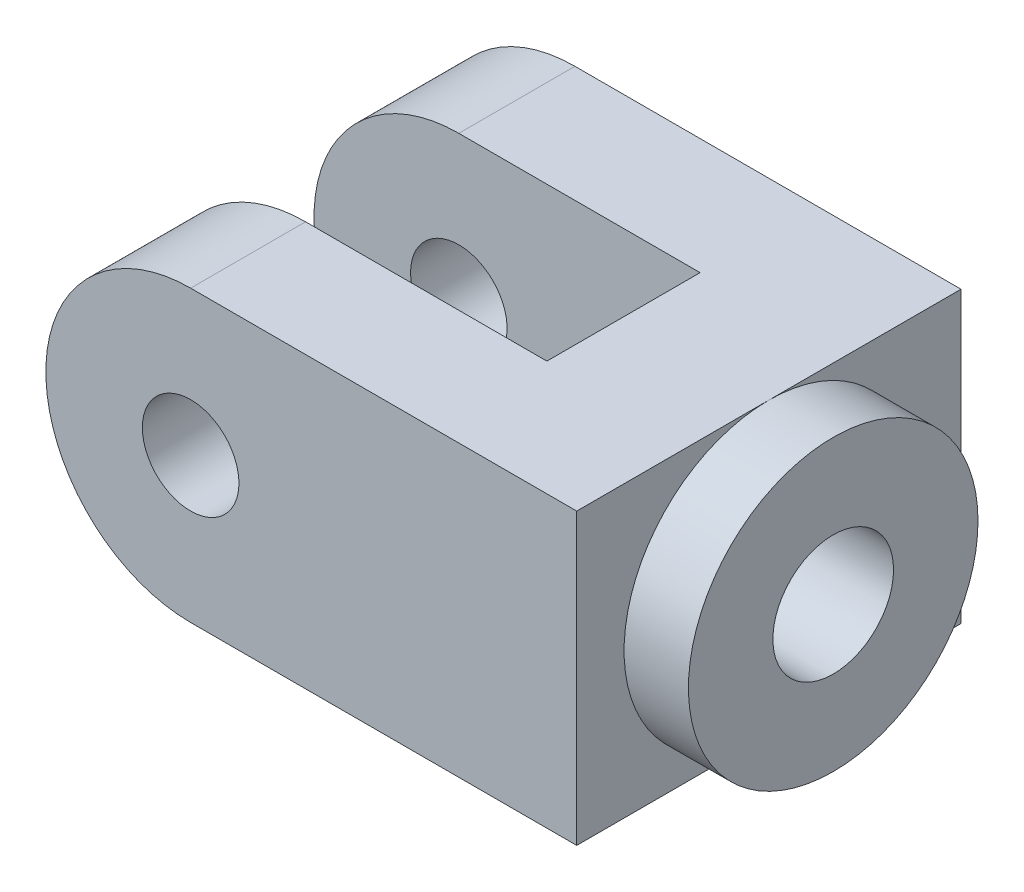
ISO-10303-21;
HEADER;
FILE_DESCRIPTION(('STEP AP214'),'2;1');
FILE_NAME('part.step','',(''),(''),'','','');
FILE_SCHEMA(('AUTOMOTIVE_DESIGN { 1 0 10303 214 1 1 1 1 }'));
ENDSEC;
DATA;
#1=APPLICATION_CONTEXT('core data for automotive mechanical design processes');
#2=APPLICATION_PROTOCOL_DEFINITION('international standard','automotive_design',2000,#1);
#3=PRODUCT_CONTEXT('',#1,'mechanical');
#4=PRODUCT('Part','Part','',(#3));
#5=PRODUCT_RELATED_PRODUCT_CATEGORY('part','',(#4));
#6=PRODUCT_DEFINITION_FORMATION('','',#4);
#7=PRODUCT_DEFINITION_CONTEXT('part definition',#1,'design');
#8=PRODUCT_DEFINITION('design','',#6,#7);
#9=PRODUCT_DEFINITION_SHAPE('','',#8);
#10=(LENGTH_UNIT() NAMED_UNIT(*) SI_UNIT(.MILLI.,.METRE.));
#11=(NAMED_UNIT(*) PLANE_ANGLE_UNIT() SI_UNIT($,.RADIAN.));
#12=(NAMED_UNIT(*) SI_UNIT($,.STERADIAN.) SOLID_ANGLE_UNIT());
#13=UNCERTAINTY_MEASURE_WITH_UNIT(LENGTH_MEASURE(1.E-05),#10,'distance_accuracy_value','');
#14=(GEOMETRIC_REPRESENTATION_CONTEXT(3) GLOBAL_UNCERTAINTY_ASSIGNED_CONTEXT((#13)) GLOBAL_UNIT_ASSIGNED_CONTEXT((#10,
#11,#12)) REPRESENTATION_CONTEXT('',''));
#15=CARTESIAN_POINT('',(0.,0.,0.));
#16=DIRECTION('',(0.,0.,1.));
#17=DIRECTION('',(1.,0.,0.));
#18=AXIS2_PLACEMENT_3D('',#15,#16,#17);
#19=CARTESIAN_POINT('',(66.,36.,95.55));
#20=DIRECTION('',(-1.,0.,0.));
#21=DIRECTION('',(0.,0.,1.));
#22=AXIS2_PLACEMENT_3D('',#19,#20,#21);
#23=PLANE('',#22);
#24=CARTESIAN_POINT('',(66.,0.,47.775));
#25=DIRECTION('',(1.,0.,0.));
#26=DIRECTION('',(0.,0.,-1.));
#27=AXIS2_PLACEMENT_3D('',#24,#25,#26);
#28=CIRCLE('',#27,36.);
#29=CARTESIAN_POINT('',(66.,36.,47.775));
#30=VERTEX_POINT('',#29);
#31=CARTESIAN_POINT('',(66.,-36.,47.775));
#32=VERTEX_POINT('',#31);
#33=EDGE_CURVE('E55',#30,#32,#28,.T.);
#34=ORIENTED_EDGE('',*,*,#33,.F.);
#35=DIRECTION('',(0.,0.,-1.));
#36=VECTOR('',#35,1.);
#37=CARTESIAN_POINT('',(66.,36.,95.55));
#38=LINE('',#37,#36);
#39=CARTESIAN_POINT('',(66.,36.,95.55));
#40=VERTEX_POINT('',#39);
#41=EDGE_CURVE('E117',#40,#30,#38,.T.);
#42=ORIENTED_EDGE('',*,*,#41,.F.);
#43=DIRECTION('',(0.,1.,0.));
#44=VECTOR('',#43,1.);
#45=CARTESIAN_POINT('',(66.,36.,95.55));
#46=LINE('',#45,#44);
#47=CARTESIAN_POINT('',(66.,-36.,95.55));
#48=VERTEX_POINT('',#47);
#49=EDGE_CURVE('E365',#48,#40,#46,.T.);
#50=ORIENTED_EDGE('',*,*,#49,.F.);
#51=DIRECTION('',(0.,0.,-1.));
#52=VECTOR('',#51,1.);
#53=CARTESIAN_POINT('',(66.,-36.,95.55));
#54=LINE('',#53,#52);
#55=EDGE_CURVE('E137',#48,#32,#54,.T.);
#56=ORIENTED_EDGE('',*,*,#55,.T.);
#57=EDGE_LOOP('',(#34,#42,#50,#56));
#58=FACE_BOUND('',#57,.T.);
#59=ADVANCED_FACE('F43',(#58),#23,.F.);
#60=CARTESIAN_POINT('',(-30.,0.,437.676333142235));
#61=DIRECTION('',(0.,0.,-1.));
#62=DIRECTION('',(-1.,0.,0.));
#63=AXIS2_PLACEMENT_3D('',#60,#61,#62);
#64=CYLINDRICAL_SURFACE('',#63,36.);
#65=DIRECTION('',(0.,0.,-1.));
#66=VECTOR('',#65,1.);
#67=CARTESIAN_POINT('',(-30.,36.,437.676333142235));
#68=LINE('',#67,#66);
#69=CARTESIAN_POINT('',(-30.,36.,95.55));
#70=VERTEX_POINT('',#69);
#71=CARTESIAN_POINT('',(-30.,36.,66.97));
#72=VERTEX_POINT('',#71);
#73=EDGE_CURVE('E350',#70,#72,#68,.T.);
#74=ORIENTED_EDGE('',*,*,#73,.T.);
#75=CARTESIAN_POINT('',(-30.,0.,66.97));
#76=DIRECTION('',(0.,0.,1.));
#77=DIRECTION('',(1.,0.,0.));
#78=AXIS2_PLACEMENT_3D('',#75,#76,#77);
#79=CIRCLE('',#78,36.);
#80=CARTESIAN_POINT('',(-30.,-36.,66.97));
#81=VERTEX_POINT('',#80);
#82=EDGE_CURVE('E53',#72,#81,#79,.T.);
#83=ORIENTED_EDGE('',*,*,#82,.T.);
#84=DIRECTION('',(0.,0.,-1.));
#85=VECTOR('',#84,1.);
#86=CARTESIAN_POINT('',(-30.,-36.,437.676333142235));
#87=LINE('',#86,#85);
#88=CARTESIAN_POINT('',(-30.,-36.,95.55));
#89=VERTEX_POINT('',#88);
#90=EDGE_CURVE('E360',#89,#81,#87,.T.);
#91=ORIENTED_EDGE('',*,*,#90,.F.);
#92=CARTESIAN_POINT('',(-30.,0.,95.55));
#93=DIRECTION('',(0.,0.,1.));
#94=DIRECTION('',(1.,0.,0.));
#95=AXIS2_PLACEMENT_3D('',#92,#93,#94);
#96=CIRCLE('',#95,36.);
#97=EDGE_CURVE('E362',#89,#70,#96,.F.);
#98=ORIENTED_EDGE('',*,*,#97,.T.);
#99=EDGE_LOOP('',(#74,#83,#91,#98));
#100=FACE_BOUND('',#99,.T.);
#101=ADVANCED_FACE('F164',(#100),#64,.T.);
#102=CARTESIAN_POINT('',(-66.,36.,95.55));
#103=DIRECTION('',(0.,-1.,0.));
#104=DIRECTION('',(0.,0.,-1.));
#105=AXIS2_PLACEMENT_3D('',#102,#103,#104);
#106=PLANE('',#105);
#107=DIRECTION('',(0.,0.,-1.));
#108=VECTOR('',#107,1.);
#109=CARTESIAN_POINT('',(30.,36.,28.87));
#110=LINE('',#109,#108);
#111=CARTESIAN_POINT('',(30.,36.,66.97));
#112=VERTEX_POINT('',#111);
#113=CARTESIAN_POINT('',(30.,36.,28.87));
#114=VERTEX_POINT('',#113);
#115=EDGE_CURVE('E346',#112,#114,#110,.T.);
#116=ORIENTED_EDGE('',*,*,#115,.F.);
#117=DIRECTION('',(1.,0.,0.));
#118=VECTOR('',#117,1.);
#119=CARTESIAN_POINT('',(30.,36.,66.97));
#120=LINE('',#119,#118);
#121=EDGE_CURVE('E345',#72,#112,#120,.T.);
#122=ORIENTED_EDGE('',*,*,#121,.F.);
#123=ORIENTED_EDGE('',*,*,#73,.F.);
#124=DIRECTION('',(-1.,0.,0.));
#125=VECTOR('',#124,1.);
#126=CARTESIAN_POINT('',(-66.,36.,95.55));
#127=LINE('',#126,#125);
#128=EDGE_CURVE('E125',#40,#70,#127,.T.);
#129=ORIENTED_EDGE('',*,*,#128,.F.);
#130=ORIENTED_EDGE('',*,*,#41,.T.);
#131=CARTESIAN_POINT('',(66.,36.,0.));
#132=VERTEX_POINT('',#131);
#133=EDGE_CURVE('E121',#30,#132,#38,.T.);
#134=ORIENTED_EDGE('',*,*,#133,.T.);
#135=DIRECTION('',(-1.,0.,0.));
#136=VECTOR('',#135,1.);
#137=CARTESIAN_POINT('',(-66.,36.,0.));
#138=LINE('',#137,#136);
#139=CARTESIAN_POINT('',(-30.,36.,0.));
#140=VERTEX_POINT('',#139);
#141=EDGE_CURVE('E348',#132,#140,#138,.T.);
#142=ORIENTED_EDGE('',*,*,#141,.T.);
#143=CARTESIAN_POINT('',(-30.,36.,28.87));
#144=VERTEX_POINT('',#143);
#145=EDGE_CURVE('E68',#144,#140,#68,.T.);
#146=ORIENTED_EDGE('',*,*,#145,.F.);
#147=DIRECTION('',(-1.,0.,0.));
#148=VECTOR('',#147,1.);
#149=CARTESIAN_POINT('',(30.,36.,28.87));
#150=LINE('',#149,#148);
#151=EDGE_CURVE('E341',#114,#144,#150,.T.);
#152=ORIENTED_EDGE('',*,*,#151,.F.);
#153=EDGE_LOOP('',(#116,#122,#123,#129,#130,#134,#142,#146,#152));
#154=FACE_BOUND('',#153,.T.);
#155=ADVANCED_FACE('F119',(#154),#106,.F.);
#156=CARTESIAN_POINT('',(0.,0.,95.55));
#157=DIRECTION('',(0.,0.,1.));
#158=DIRECTION('',(1.,0.,0.));
#159=AXIS2_PLACEMENT_3D('',#156,#157,#158);
#160=PLANE('',#159);
#161=CARTESIAN_POINT('',(-30.,0.,95.55));
#162=DIRECTION('',(0.,0.,-1.));
#163=DIRECTION('',(-1.,0.,0.));
#164=AXIS2_PLACEMENT_3D('',#161,#162,#163);
#165=CIRCLE('',#164,12.);
#166=CARTESIAN_POINT('',(-42.,0.,95.55));
#167=VERTEX_POINT('',#166);
#168=EDGE_CURVE('E435',#167,#167,#165,.T.);
#169=ORIENTED_EDGE('',*,*,#168,.T.);
#170=EDGE_LOOP('',(#169));
#171=FACE_BOUND('',#170,.T.);
#172=ORIENTED_EDGE('',*,*,#97,.F.);
#173=DIRECTION('',(1.,0.,0.));
#174=VECTOR('',#173,1.);
#175=CARTESIAN_POINT('',(-66.,-36.,95.55));
#176=LINE('',#175,#174);
#177=EDGE_CURVE('E371',#89,#48,#176,.T.);
#178=ORIENTED_EDGE('',*,*,#177,.T.);
#179=ORIENTED_EDGE('',*,*,#49,.T.);
#180=ORIENTED_EDGE('',*,*,#128,.T.);
#181=EDGE_LOOP('',(#172,#178,#179,#180));
#182=FACE_BOUND('',#181,.T.);
#183=ADVANCED_FACE('F180',(#171,#182),#160,.T.);
#184=CARTESIAN_POINT('',(0.,0.,0.));
#185=DIRECTION('',(0.,0.,1.));
#186=DIRECTION('',(1.,0.,0.));
#187=AXIS2_PLACEMENT_3D('',#184,#185,#186);
#188=PLANE('',#187);
#189=CARTESIAN_POINT('',(-30.,0.,0.));
#190=DIRECTION('',(0.,0.,-1.));
#191=DIRECTION('',(-1.,0.,0.));
#192=AXIS2_PLACEMENT_3D('',#189,#190,#191);
#193=CIRCLE('',#192,12.);
#194=CARTESIAN_POINT('',(-42.,0.,0.));
#195=VERTEX_POINT('',#194);
#196=EDGE_CURVE('E431',#195,#195,#193,.T.);
#197=ORIENTED_EDGE('',*,*,#196,.F.);
#198=EDGE_LOOP('',(#197));
#199=FACE_BOUND('',#198,.T.);
#200=DIRECTION('',(1.,0.,0.));
#201=VECTOR('',#200,1.);
#202=CARTESIAN_POINT('',(-66.,-36.,0.));
#203=LINE('',#202,#201);
#204=CARTESIAN_POINT('',(-30.,-36.,0.));
#205=VERTEX_POINT('',#204);
#206=CARTESIAN_POINT('',(66.,-36.,0.));
#207=VERTEX_POINT('',#206);
#208=EDGE_CURVE('E368',#205,#207,#203,.T.);
#209=ORIENTED_EDGE('',*,*,#208,.F.);
#210=CARTESIAN_POINT('',(-30.,0.,0.));
#211=DIRECTION('',(0.,0.,1.));
#212=DIRECTION('',(1.,0.,0.));
#213=AXIS2_PLACEMENT_3D('',#210,#211,#212);
#214=CIRCLE('',#213,36.);
#215=EDGE_CURVE('E131',#205,#140,#214,.F.);
#216=ORIENTED_EDGE('',*,*,#215,.T.);
#217=ORIENTED_EDGE('',*,*,#141,.F.);
#218=DIRECTION('',(0.,1.,0.));
#219=VECTOR('',#218,1.);
#220=CARTESIAN_POINT('',(66.,36.,0.));
#221=LINE('',#220,#219);
#222=EDGE_CURVE('E135',#207,#132,#221,.T.);
#223=ORIENTED_EDGE('',*,*,#222,.F.);
#224=EDGE_LOOP('',(#209,#216,#217,#223));
#225=FACE_BOUND('',#224,.T.);
#226=ADVANCED_FACE('F173',(#199,#225),#188,.F.);
#227=EDGE_CURVE('E11',#32,#30,#28,.T.);
#228=ORIENTED_EDGE('',*,*,#227,.F.);
#229=EDGE_CURVE('E374',#32,#207,#54,.T.);
#230=ORIENTED_EDGE('',*,*,#229,.T.);
#231=ORIENTED_EDGE('',*,*,#222,.T.);
#232=ORIENTED_EDGE('',*,*,#133,.F.);
#233=EDGE_LOOP('',(#228,#230,#231,#232));
#234=FACE_BOUND('',#233,.T.);
#235=ADVANCED_FACE('F45',(#234),#23,.F.);
#236=CARTESIAN_POINT('',(-66.,-36.,95.55));
#237=DIRECTION('',(0.,1.,0.));
#238=DIRECTION('',(0.,0.,1.));
#239=AXIS2_PLACEMENT_3D('',#236,#237,#238);
#240=PLANE('',#239);
#241=ORIENTED_EDGE('',*,*,#90,.T.);
#242=DIRECTION('',(1.,0.,0.));
#243=VECTOR('',#242,1.);
#244=CARTESIAN_POINT('',(30.,-36.,66.97));
#245=LINE('',#244,#243);
#246=CARTESIAN_POINT('',(30.,-36.,66.97));
#247=VERTEX_POINT('',#246);
#248=EDGE_CURVE('E407',#81,#247,#245,.T.);
#249=ORIENTED_EDGE('',*,*,#248,.T.);
#250=DIRECTION('',(0.,0.,-1.));
#251=VECTOR('',#250,1.);
#252=CARTESIAN_POINT('',(30.,-36.,28.87));
#253=LINE('',#252,#251);
#254=CARTESIAN_POINT('',(30.,-36.,28.87));
#255=VERTEX_POINT('',#254);
#256=EDGE_CURVE('E400',#247,#255,#253,.T.);
#257=ORIENTED_EDGE('',*,*,#256,.T.);
#258=DIRECTION('',(-1.,0.,0.));
#259=VECTOR('',#258,1.);
#260=CARTESIAN_POINT('',(30.,-36.,28.87));
#261=LINE('',#260,#259);
#262=CARTESIAN_POINT('',(-30.,-36.,28.87));
#263=VERTEX_POINT('',#262);
#264=EDGE_CURVE('E404',#255,#263,#261,.T.);
#265=ORIENTED_EDGE('',*,*,#264,.T.);
#266=EDGE_CURVE('E334',#263,#205,#87,.T.);
#267=ORIENTED_EDGE('',*,*,#266,.T.);
#268=ORIENTED_EDGE('',*,*,#208,.T.);
#269=ORIENTED_EDGE('',*,*,#229,.F.);
#270=ORIENTED_EDGE('',*,*,#55,.F.);
#271=ORIENTED_EDGE('',*,*,#177,.F.);
#272=EDGE_LOOP('',(#241,#249,#257,#265,#267,#268,#269,#270,#271));
#273=FACE_BOUND('',#272,.T.);
#274=ADVANCED_FACE('F172',(#273),#240,.F.);
#275=CARTESIAN_POINT('',(-30.,0.,28.87));
#276=DIRECTION('',(0.,0.,-1.));
#277=DIRECTION('',(-1.,0.,0.));
#278=AXIS2_PLACEMENT_3D('',#275,#276,#277);
#279=CIRCLE('',#278,36.);
#280=EDGE_CURVE('E332',#263,#144,#279,.T.);
#281=ORIENTED_EDGE('',*,*,#280,.T.);
#282=ORIENTED_EDGE('',*,*,#145,.T.);
#283=ORIENTED_EDGE('',*,*,#215,.F.);
#284=ORIENTED_EDGE('',*,*,#266,.F.);
#285=EDGE_LOOP('',(#281,#282,#283,#284));
#286=FACE_BOUND('',#285,.T.);
#287=ADVANCED_FACE('F170',(#286),#64,.T.);
#288=CARTESIAN_POINT('',(30.,-36.,66.97));
#289=DIRECTION('',(0.,0.,1.));
#290=DIRECTION('',(1.,0.,0.));
#291=AXIS2_PLACEMENT_3D('',#288,#289,#290);
#292=PLANE('',#291);
#293=CARTESIAN_POINT('',(-30.,0.,66.97));
#294=DIRECTION('',(0.,0.,1.));
#295=DIRECTION('',(1.,0.,0.));
#296=AXIS2_PLACEMENT_3D('',#293,#294,#295);
#297=CIRCLE('',#296,12.);
#298=CARTESIAN_POINT('',(-18.,0.,66.97));
#299=VERTEX_POINT('',#298);
#300=EDGE_CURVE('E427',#299,#299,#297,.T.);
#301=ORIENTED_EDGE('',*,*,#300,.T.);
#302=EDGE_LOOP('',(#301));
#303=FACE_BOUND('',#302,.T.);
#304=ORIENTED_EDGE('',*,*,#121,.T.);
#305=DIRECTION('',(0.,1.,0.));
#306=VECTOR('',#305,1.);
#307=CARTESIAN_POINT('',(30.,-36.,66.97));
#308=LINE('',#307,#306);
#309=EDGE_CURVE('E351',#247,#112,#308,.T.);
#310=ORIENTED_EDGE('',*,*,#309,.F.);
#311=ORIENTED_EDGE('',*,*,#248,.F.);
#312=ORIENTED_EDGE('',*,*,#82,.F.);
#313=EDGE_LOOP('',(#304,#310,#311,#312));
#314=FACE_BOUND('',#313,.T.);
#315=ADVANCED_FACE('F215',(#303,#314),#292,.F.);
#316=CARTESIAN_POINT('',(30.,-36.,28.87));
#317=DIRECTION('',(0.,0.,-1.));
#318=DIRECTION('',(-1.,0.,0.));
#319=AXIS2_PLACEMENT_3D('',#316,#317,#318);
#320=PLANE('',#319);
#321=CARTESIAN_POINT('',(-30.,0.,28.87));
#322=DIRECTION('',(0.,0.,-1.));
#323=DIRECTION('',(-1.,0.,0.));
#324=AXIS2_PLACEMENT_3D('',#321,#322,#323);
#325=CIRCLE('',#324,12.);
#326=CARTESIAN_POINT('',(-42.,0.,28.87));
#327=VERTEX_POINT('',#326);
#328=EDGE_CURVE('E47',#327,#327,#325,.T.);
#329=ORIENTED_EDGE('',*,*,#328,.T.);
#330=EDGE_LOOP('',(#329));
#331=FACE_BOUND('',#330,.T.);
#332=ORIENTED_EDGE('',*,*,#280,.F.);
#333=ORIENTED_EDGE('',*,*,#264,.F.);
#334=DIRECTION('',(0.,1.,0.));
#335=VECTOR('',#334,1.);
#336=CARTESIAN_POINT('',(30.,-36.,28.87));
#337=LINE('',#336,#335);
#338=EDGE_CURVE('E342',#255,#114,#337,.T.);
#339=ORIENTED_EDGE('',*,*,#338,.T.);
#340=ORIENTED_EDGE('',*,*,#151,.T.);
#341=EDGE_LOOP('',(#332,#333,#339,#340));
#342=FACE_BOUND('',#341,.T.);
#343=ADVANCED_FACE('F220',(#331,#342),#320,.F.);
#344=CARTESIAN_POINT('',(30.,-36.,28.87));
#345=DIRECTION('',(1.,0.,0.));
#346=DIRECTION('',(0.,0.,-1.));
#347=AXIS2_PLACEMENT_3D('',#344,#345,#346);
#348=PLANE('',#347);
#349=CARTESIAN_POINT('',(30.,0.,47.775));
#350=DIRECTION('',(1.,0.,0.));
#351=DIRECTION('',(0.,0.,-1.));
#352=AXIS2_PLACEMENT_3D('',#349,#350,#351);
#353=CIRCLE('',#352,15.);
#354=CARTESIAN_POINT('',(30.,0.,32.775));
#355=VERTEX_POINT('',#354);
#356=EDGE_CURVE('E388',#355,#355,#353,.T.);
#357=ORIENTED_EDGE('',*,*,#356,.T.);
#358=EDGE_LOOP('',(#357));
#359=FACE_BOUND('',#358,.T.);
#360=ORIENTED_EDGE('',*,*,#115,.T.);
#361=ORIENTED_EDGE('',*,*,#338,.F.);
#362=ORIENTED_EDGE('',*,*,#256,.F.);
#363=ORIENTED_EDGE('',*,*,#309,.T.);
#364=EDGE_LOOP('',(#360,#361,#362,#363));
#365=FACE_BOUND('',#364,.T.);
#366=ADVANCED_FACE('F233',(#359,#365),#348,.F.);
#367=CARTESIAN_POINT('',(-66.,0.,47.775));
#368=DIRECTION('',(1.,0.,0.));
#369=DIRECTION('',(0.,0.,-1.));
#370=AXIS2_PLACEMENT_3D('',#367,#368,#369);
#371=CYLINDRICAL_SURFACE('',#370,15.);
#372=ORIENTED_EDGE('',*,*,#356,.F.);
#373=EDGE_LOOP('',(#372));
#374=FACE_BOUND('',#373,.T.);
#375=CARTESIAN_POINT('',(82.,0.,47.775));
#376=DIRECTION('',(1.,0.,0.));
#377=DIRECTION('',(0.,0.,-1.));
#378=AXIS2_PLACEMENT_3D('',#375,#376,#377);
#379=CIRCLE('',#378,15.);
#380=CARTESIAN_POINT('',(82.,0.,32.775));
#381=VERTEX_POINT('',#380);
#382=EDGE_CURVE('E144',#381,#381,#379,.T.);
#383=ORIENTED_EDGE('',*,*,#382,.T.);
#384=EDGE_LOOP('',(#383));
#385=FACE_BOUND('',#384,.T.);
#386=ADVANCED_FACE('F158',(#374,#385),#371,.F.);
#387=CARTESIAN_POINT('',(82.,0.,47.775));
#388=DIRECTION('',(1.,0.,0.));
#389=DIRECTION('',(0.,0.,-1.));
#390=AXIS2_PLACEMENT_3D('',#387,#388,#389);
#391=PLANE('',#390);
#392=CARTESIAN_POINT('',(82.,0.,47.775));
#393=DIRECTION('',(1.,0.,0.));
#394=DIRECTION('',(0.,0.,-1.));
#395=AXIS2_PLACEMENT_3D('',#392,#393,#394);
#396=CIRCLE('',#395,36.);
#397=CARTESIAN_POINT('',(82.,0.,11.775));
#398=VERTEX_POINT('',#397);
#399=EDGE_CURVE('E143',#398,#398,#396,.T.);
#400=ORIENTED_EDGE('',*,*,#399,.T.);
#401=EDGE_LOOP('',(#400));
#402=FACE_BOUND('',#401,.T.);
#403=ORIENTED_EDGE('',*,*,#382,.F.);
#404=EDGE_LOOP('',(#403));
#405=FACE_BOUND('',#404,.T.);
#406=ADVANCED_FACE('F148',(#402,#405),#391,.T.);
#407=CARTESIAN_POINT('',(82.,0.,47.775));
#408=DIRECTION('',(-1.,0.,0.));
#409=DIRECTION('',(0.,0.,1.));
#410=AXIS2_PLACEMENT_3D('',#407,#408,#409);
#411=CYLINDRICAL_SURFACE('',#410,36.);
#412=ORIENTED_EDGE('',*,*,#399,.F.);
#413=EDGE_LOOP('',(#412));
#414=FACE_BOUND('',#413,.T.);
#415=ORIENTED_EDGE('',*,*,#33,.T.);
#416=ORIENTED_EDGE('',*,*,#227,.T.);
#417=EDGE_LOOP('',(#415,#416));
#418=FACE_BOUND('',#417,.T.);
#419=ADVANCED_FACE('F145',(#414,#418),#411,.T.);
#420=CARTESIAN_POINT('',(-30.,0.,95.55));
#421=DIRECTION('',(0.,0.,-1.));
#422=DIRECTION('',(-1.,0.,0.));
#423=AXIS2_PLACEMENT_3D('',#420,#421,#422);
#424=CYLINDRICAL_SURFACE('',#423,12.);
#425=ORIENTED_EDGE('',*,*,#196,.T.);
#426=EDGE_LOOP('',(#425));
#427=FACE_BOUND('',#426,.T.);
#428=ORIENTED_EDGE('',*,*,#328,.F.);
#429=EDGE_LOOP('',(#428));
#430=FACE_BOUND('',#429,.T.);
#431=ADVANCED_FACE('F147',(#427,#430),#424,.F.);
#432=ORIENTED_EDGE('',*,*,#168,.F.);
#433=EDGE_LOOP('',(#432));
#434=FACE_BOUND('',#433,.T.);
#435=ORIENTED_EDGE('',*,*,#300,.F.);
#436=EDGE_LOOP('',(#435));
#437=FACE_BOUND('',#436,.T.);
#438=ADVANCED_FACE('F155',(#434,#437),#424,.F.);
#439=CLOSED_SHELL('',(#59,#101,#155,#183,#226,#235,#274,#287,#315,#343,#366,#386,#406,#419,#431,#438));
#440=MANIFOLD_SOLID_BREP('B2',#439);
#441=ADVANCED_BREP_SHAPE_REPRESENTATION('',(#18,#440),#14);
#442=SHAPE_DEFINITION_REPRESENTATION(#9,#441);
ENDSEC;
END-ISO-10303-21;
